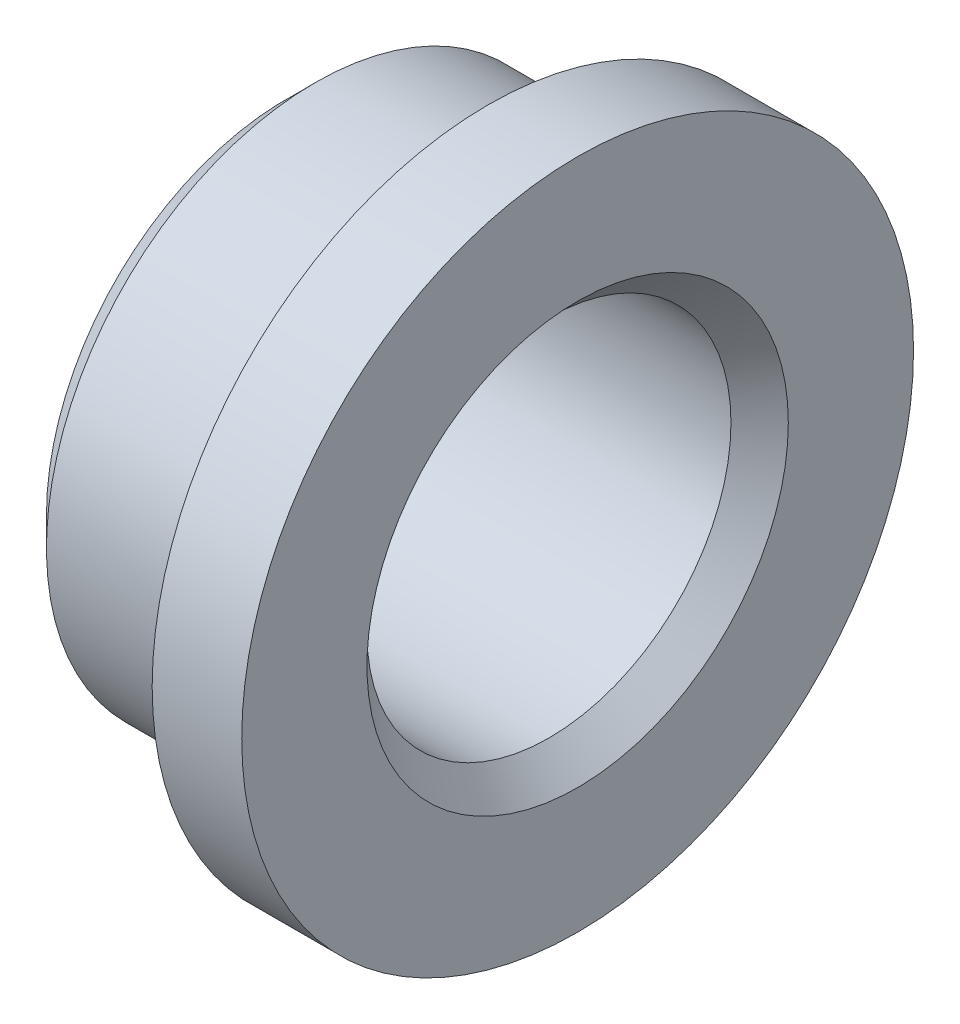
ISO-10303-21;
HEADER;
FILE_DESCRIPTION(('STEP AP214'),'2;1');
FILE_NAME('part.step','',(''),(''),'','','');
FILE_SCHEMA(('AUTOMOTIVE_DESIGN { 1 0 10303 214 1 1 1 1 }'));
ENDSEC;
DATA;
#1=APPLICATION_CONTEXT('core data for automotive mechanical design processes');
#2=APPLICATION_PROTOCOL_DEFINITION('international standard','automotive_design',2000,#1);
#3=PRODUCT_CONTEXT('',#1,'mechanical');
#4=PRODUCT('Part','Part','',(#3));
#5=PRODUCT_RELATED_PRODUCT_CATEGORY('part','',(#4));
#6=PRODUCT_DEFINITION_FORMATION('','',#4);
#7=PRODUCT_DEFINITION_CONTEXT('part definition',#1,'design');
#8=PRODUCT_DEFINITION('design','',#6,#7);
#9=PRODUCT_DEFINITION_SHAPE('','',#8);
#10=(LENGTH_UNIT() NAMED_UNIT(*) SI_UNIT(.MILLI.,.METRE.));
#11=(NAMED_UNIT(*) PLANE_ANGLE_UNIT() SI_UNIT($,.RADIAN.));
#12=(NAMED_UNIT(*) SI_UNIT($,.STERADIAN.) SOLID_ANGLE_UNIT());
#13=UNCERTAINTY_MEASURE_WITH_UNIT(LENGTH_MEASURE(1.E-05),#10,'distance_accuracy_value','');
#14=(GEOMETRIC_REPRESENTATION_CONTEXT(3) GLOBAL_UNCERTAINTY_ASSIGNED_CONTEXT((#13)) GLOBAL_UNIT_ASSIGNED_CONTEXT((#10,
#11,#12)) REPRESENTATION_CONTEXT('',''));
#15=CARTESIAN_POINT('',(0.,0.,0.));
#16=DIRECTION('',(0.,0.,1.));
#17=DIRECTION('',(1.,0.,0.));
#18=AXIS2_PLACEMENT_3D('',#15,#16,#17);
#19=CARTESIAN_POINT('',(7.14375,10.7156250000001,0.));
#20=DIRECTION('',(-1.,0.,0.));
#21=DIRECTION('',(0.,0.,1.));
#22=AXIS2_PLACEMENT_3D('',#19,#20,#21);
#23=PLANE('',#22);
#24=CARTESIAN_POINT('',(7.14375,0.,0.));
#25=DIRECTION('',(1.,0.,0.));
#26=DIRECTION('',(0.,0.,-1.));
#27=AXIS2_PLACEMENT_3D('',#24,#25,#26);
#28=CIRCLE('',#27,9.525);
#29=CARTESIAN_POINT('',(7.14375,0.,-9.525));
#30=VERTEX_POINT('',#29);
#31=EDGE_CURVE('E18',#30,#30,#28,.F.);
#32=ORIENTED_EDGE('',*,*,#31,.F.);
#33=EDGE_LOOP('',(#32));
#34=FACE_BOUND('',#33,.T.);
#35=CARTESIAN_POINT('',(7.14375,0.,0.));
#36=DIRECTION('',(1.,0.,0.));
#37=DIRECTION('',(0.,0.,-1.));
#38=AXIS2_PLACEMENT_3D('',#35,#36,#37);
#39=CIRCLE('',#38,11.9062500000001);
#40=CARTESIAN_POINT('',(7.14375,0.,-11.9062500000001));
#41=VERTEX_POINT('',#40);
#42=EDGE_CURVE('E36',#41,#41,#39,.T.);
#43=ORIENTED_EDGE('',*,*,#42,.F.);
#44=EDGE_LOOP('',(#43));
#45=FACE_BOUND('',#44,.T.);
#46=ADVANCED_FACE('F15',(#34,#45),#23,.T.);
#47=CARTESIAN_POINT('',(4.079875,0.,0.));
#48=DIRECTION('',(1.,0.,0.));
#49=DIRECTION('',(0.,0.,-1.));
#50=AXIS2_PLACEMENT_3D('',#47,#48,#49);
#51=CYLINDRICAL_SURFACE('',#50,9.525);
#52=CARTESIAN_POINT('',(1.01600000045589,0.,0.));
#53=DIRECTION('',(1.,0.,0.));
#54=DIRECTION('',(0.,1.,0.));
#55=AXIS2_PLACEMENT_3D('',#52,#53,#54);
#56=CIRCLE('',#55,9.52499999954409);
#57=CARTESIAN_POINT('',(1.01600000045589,9.52499999954409,0.));
#58=VERTEX_POINT('',#57);
#59=EDGE_CURVE('E32',#58,#58,#56,.F.);
#60=ORIENTED_EDGE('',*,*,#59,.F.);
#61=EDGE_LOOP('',(#60));
#62=FACE_BOUND('',#61,.T.);
#63=ORIENTED_EDGE('',*,*,#31,.T.);
#64=EDGE_LOOP('',(#63));
#65=FACE_BOUND('',#64,.T.);
#66=ADVANCED_FACE('F51',(#62,#65),#51,.T.);
#67=CARTESIAN_POINT('',(8.73124999999995,0.,0.));
#68=DIRECTION('',(1.,0.,0.));
#69=DIRECTION('',(0.,0.,-1.));
#70=AXIS2_PLACEMENT_3D('',#67,#68,#69);
#71=CYLINDRICAL_SURFACE('',#70,11.9062500000001);
#72=ORIENTED_EDGE('',*,*,#42,.T.);
#73=EDGE_LOOP('',(#72));
#74=FACE_BOUND('',#73,.T.);
#75=CARTESIAN_POINT('',(10.3187499999999,0.,0.));
#76=DIRECTION('',(1.,0.,0.));
#77=DIRECTION('',(0.,0.,-1.));
#78=AXIS2_PLACEMENT_3D('',#75,#76,#77);
#79=CIRCLE('',#78,11.9062500000001);
#80=CARTESIAN_POINT('',(10.3187499999999,0.,-11.9062500000001));
#81=VERTEX_POINT('',#80);
#82=EDGE_CURVE('E35',#81,#81,#79,.T.);
#83=ORIENTED_EDGE('',*,*,#82,.F.);
#84=EDGE_LOOP('',(#83));
#85=FACE_BOUND('',#84,.T.);
#86=ADVANCED_FACE('F59',(#74,#85),#71,.T.);
#87=CARTESIAN_POINT('',(1.01600000045589,0.,0.));
#88=DIRECTION('',(1.,0.,0.));
#89=DIRECTION('',(0.,0.,-1.));
#90=AXIS2_PLACEMENT_3D('',#87,#88,#89);
#91=CONICAL_SURFACE('',#90,9.52499999954409,0.785398162499977);
#92=CARTESIAN_POINT('',(-4.55938021712288E-10,0.,0.));
#93=DIRECTION('',(1.,0.,0.));
#94=DIRECTION('',(0.,0.,-1.));
#95=AXIS2_PLACEMENT_3D('',#92,#93,#94);
#96=CIRCLE('',#95,8.50900000045592);
#97=CARTESIAN_POINT('',(-4.55937924856894E-10,0.,-8.50900000045592));
#98=VERTEX_POINT('',#97);
#99=EDGE_CURVE('E41',#98,#98,#96,.F.);
#100=ORIENTED_EDGE('',*,*,#99,.F.);
#101=EDGE_LOOP('',(#100));
#102=FACE_BOUND('',#101,.T.);
#103=ORIENTED_EDGE('',*,*,#59,.T.);
#104=EDGE_LOOP('',(#103));
#105=FACE_BOUND('',#104,.T.);
#106=ADVANCED_FACE('F80',(#102,#105),#91,.T.);
#107=CARTESIAN_POINT('',(10.3187499999999,9.68692500000005,0.));
#108=DIRECTION('',(1.,0.,0.));
#109=DIRECTION('',(0.,0.,-1.));
#110=AXIS2_PLACEMENT_3D('',#107,#108,#109);
#111=PLANE('',#110);
#112=CARTESIAN_POINT('',(10.3187500004083,0.,0.));
#113=DIRECTION('',(1.,0.,0.));
#114=DIRECTION('',(0.,0.,-1.));
#115=AXIS2_PLACEMENT_3D('',#112,#113,#114);
#116=CIRCLE('',#115,7.46759999952928);
#117=CARTESIAN_POINT('',(10.3187500004083,0.,-7.46759999952928));
#118=VERTEX_POINT('',#117);
#119=EDGE_CURVE('E27',#118,#118,#116,.F.);
#120=ORIENTED_EDGE('',*,*,#119,.T.);
#121=EDGE_LOOP('',(#120));
#122=FACE_BOUND('',#121,.T.);
#123=ORIENTED_EDGE('',*,*,#82,.T.);
#124=EDGE_LOOP('',(#123));
#125=FACE_BOUND('',#124,.T.);
#126=ADVANCED_FACE('F76',(#122,#125),#111,.T.);
#127=CARTESIAN_POINT('',(0.,7.48029999999998,0.));
#128=DIRECTION('',(-1.,0.,0.));
#129=DIRECTION('',(0.,0.,1.));
#130=AXIS2_PLACEMENT_3D('',#127,#128,#129);
#131=PLANE('',#130);
#132=CARTESIAN_POINT('',(0.,0.,0.));
#133=DIRECTION('',(1.,0.,0.));
#134=DIRECTION('',(0.,0.,-1.));
#135=AXIS2_PLACEMENT_3D('',#132,#133,#134);
#136=CIRCLE('',#135,6.4516);
#137=CARTESIAN_POINT('',(0.,0.,-6.4516));
#138=VERTEX_POINT('',#137);
#139=EDGE_CURVE('E22',#138,#138,#136,.T.);
#140=ORIENTED_EDGE('',*,*,#139,.T.);
#141=EDGE_LOOP('',(#140));
#142=FACE_BOUND('',#141,.T.);
#143=ORIENTED_EDGE('',*,*,#99,.T.);
#144=EDGE_LOOP('',(#143));
#145=FACE_BOUND('',#144,.T.);
#146=ADVANCED_FACE('F69',(#142,#145),#131,.T.);
#147=CARTESIAN_POINT('',(10.3187500004083,0.,0.));
#148=DIRECTION('',(1.,0.,0.));
#149=DIRECTION('',(0.,0.,-1.));
#150=AXIS2_PLACEMENT_3D('',#147,#148,#149);
#151=CONICAL_SURFACE('',#150,7.46759999952928,0.785398162502276);
#152=ORIENTED_EDGE('',*,*,#119,.F.);
#153=EDGE_LOOP('',(#152));
#154=FACE_BOUND('',#153,.T.);
#155=CARTESIAN_POINT('',(9.30274999999993,0.,0.));
#156=DIRECTION('',(1.,0.,0.));
#157=DIRECTION('',(0.,0.,-1.));
#158=AXIS2_PLACEMENT_3D('',#155,#156,#157);
#159=CIRCLE('',#158,6.4516);
#160=CARTESIAN_POINT('',(9.30274999999993,0.,-6.4516));
#161=VERTEX_POINT('',#160);
#162=EDGE_CURVE('E10',#161,#161,#159,.F.);
#163=ORIENTED_EDGE('',*,*,#162,.T.);
#164=EDGE_LOOP('',(#163));
#165=FACE_BOUND('',#164,.T.);
#166=ADVANCED_FACE('F63',(#154,#165),#151,.F.);
#167=CARTESIAN_POINT('',(4.65137499999997,0.,0.));
#168=DIRECTION('',(1.,0.,0.));
#169=DIRECTION('',(0.,0.,-1.));
#170=AXIS2_PLACEMENT_3D('',#167,#168,#169);
#171=CYLINDRICAL_SURFACE('',#170,6.4516);
#172=ORIENTED_EDGE('',*,*,#162,.F.);
#173=EDGE_LOOP('',(#172));
#174=FACE_BOUND('',#173,.T.);
#175=ORIENTED_EDGE('',*,*,#139,.F.);
#176=EDGE_LOOP('',(#175));
#177=FACE_BOUND('',#176,.T.);
#178=ADVANCED_FACE('F61',(#174,#177),#171,.F.);
#179=CLOSED_SHELL('',(#46,#66,#86,#106,#126,#146,#166,#178));
#180=MANIFOLD_SOLID_BREP('B1',#179);
#181=ADVANCED_BREP_SHAPE_REPRESENTATION('',(#18,#180),#14);
#182=SHAPE_DEFINITION_REPRESENTATION(#9,#181);
ENDSEC;
END-ISO-10303-21;
